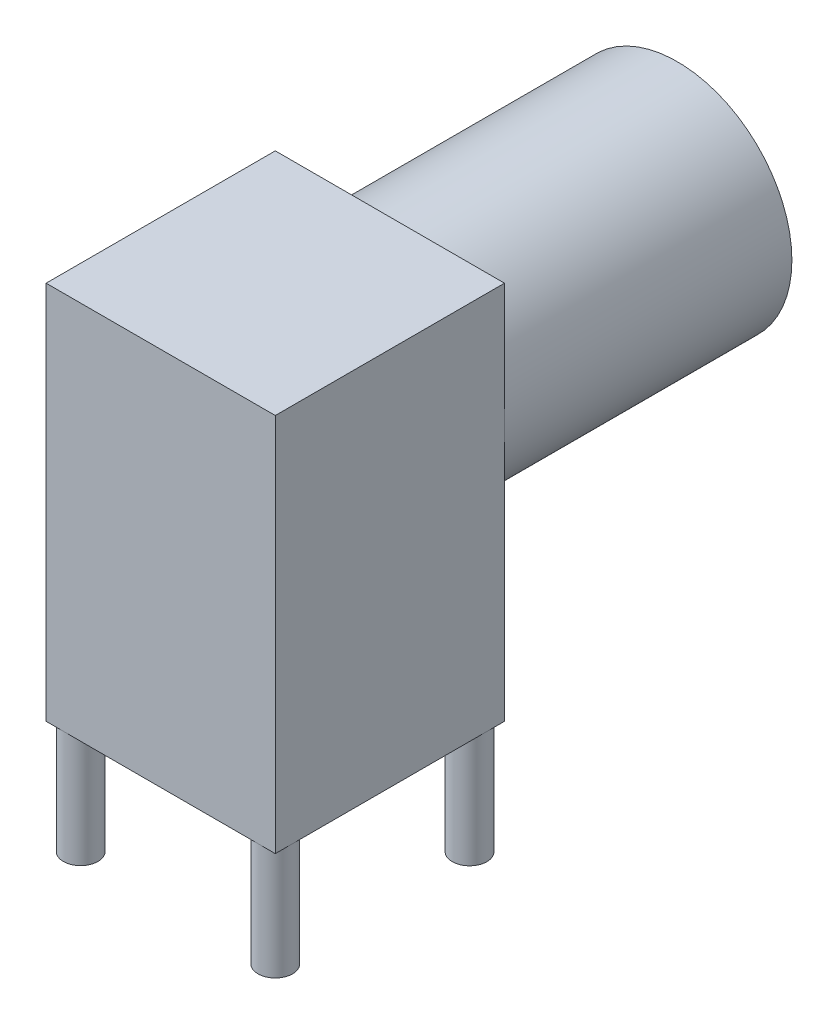
ISO-10303-21;
HEADER;
FILE_DESCRIPTION(('STEP AP214'),'2;1');
FILE_NAME('part.step','',(''),(''),'','','');
FILE_SCHEMA(('AUTOMOTIVE_DESIGN { 1 0 10303 214 1 1 1 1 }'));
ENDSEC;
DATA;
#1=APPLICATION_CONTEXT('core data for automotive mechanical design processes');
#2=APPLICATION_PROTOCOL_DEFINITION('international standard','automotive_design',2000,#1);
#3=PRODUCT_CONTEXT('',#1,'mechanical');
#4=PRODUCT('Part','Part','',(#3));
#5=PRODUCT_RELATED_PRODUCT_CATEGORY('part','',(#4));
#6=PRODUCT_DEFINITION_FORMATION('','',#4);
#7=PRODUCT_DEFINITION_CONTEXT('part definition',#1,'design');
#8=PRODUCT_DEFINITION('design','',#6,#7);
#9=PRODUCT_DEFINITION_SHAPE('','',#8);
#10=(LENGTH_UNIT() NAMED_UNIT(*) SI_UNIT(.MILLI.,.METRE.));
#11=(NAMED_UNIT(*) PLANE_ANGLE_UNIT() SI_UNIT($,.RADIAN.));
#12=(NAMED_UNIT(*) SI_UNIT($,.STERADIAN.) SOLID_ANGLE_UNIT());
#13=UNCERTAINTY_MEASURE_WITH_UNIT(LENGTH_MEASURE(1.E-05),#10,'distance_accuracy_value','');
#14=(GEOMETRIC_REPRESENTATION_CONTEXT(3) GLOBAL_UNCERTAINTY_ASSIGNED_CONTEXT((#13)) GLOBAL_UNIT_ASSIGNED_CONTEXT((#10,
#11,#12)) REPRESENTATION_CONTEXT('',''));
#15=CARTESIAN_POINT('',(0.,0.,0.));
#16=DIRECTION('',(0.,0.,1.));
#17=DIRECTION('',(1.,0.,0.));
#18=AXIS2_PLACEMENT_3D('',#15,#16,#17);
#19=CARTESIAN_POINT('',(0.,0.,0.));
#20=DIRECTION('',(0.,1.,0.));
#21=DIRECTION('',(0.,0.,1.));
#22=AXIS2_PLACEMENT_3D('',#19,#20,#21);
#23=PLANE('',#22);
#24=CARTESIAN_POINT('',(0.,0.,0.));
#25=DIRECTION('',(0.,1.,0.));
#26=DIRECTION('',(0.,0.,1.));
#27=AXIS2_PLACEMENT_3D('',#24,#25,#26);
#28=CIRCLE('',#27,0.475);
#29=CARTESIAN_POINT('',(0.,0.,0.475));
#30=VERTEX_POINT('',#29);
#31=EDGE_CURVE('E11',#30,#30,#28,.F.);
#32=ORIENTED_EDGE('',*,*,#31,.F.);
#33=EDGE_LOOP('',(#32));
#34=FACE_BOUND('',#33,.T.);
#35=DIRECTION('',(0.,0.,-1.));
#36=VECTOR('',#35,1.);
#37=CARTESIAN_POINT('',(3.15,0.,3.15));
#38=LINE('',#37,#36);
#39=CARTESIAN_POINT('',(3.15,0.,-2.66524354008799));
#40=VERTEX_POINT('',#39);
#41=CARTESIAN_POINT('',(3.15,0.,-3.15));
#42=VERTEX_POINT('',#41);
#43=EDGE_CURVE('E103',#40,#42,#38,.T.);
#44=ORIENTED_EDGE('',*,*,#43,.F.);
#45=CARTESIAN_POINT('',(2.675,0.,-2.66524354008799));
#46=DIRECTION('',(0.,-1.,0.));
#47=DIRECTION('',(0.,0.,-1.));
#48=AXIS2_PLACEMENT_3D('',#45,#46,#47);
#49=CIRCLE('',#48,0.475);
#50=EDGE_CURVE('E114',#40,#40,#49,.T.);
#51=ORIENTED_EDGE('',*,*,#50,.F.);
#52=CARTESIAN_POINT('',(3.15,0.,2.675));
#53=VERTEX_POINT('',#52);
#54=EDGE_CURVE('E99',#53,#40,#38,.T.);
#55=ORIENTED_EDGE('',*,*,#54,.F.);
#56=CARTESIAN_POINT('',(2.675,0.,2.675));
#57=DIRECTION('',(0.,-1.,0.));
#58=DIRECTION('',(0.,0.,-1.));
#59=AXIS2_PLACEMENT_3D('',#56,#57,#58);
#60=CIRCLE('',#59,0.475);
#61=CARTESIAN_POINT('',(2.675,0.,3.15));
#62=VERTEX_POINT('',#61);
#63=EDGE_CURVE('E167',#62,#53,#60,.T.);
#64=ORIENTED_EDGE('',*,*,#63,.F.);
#65=DIRECTION('',(1.,0.,0.));
#66=VECTOR('',#65,1.);
#67=CARTESIAN_POINT('',(3.15,0.,3.15));
#68=LINE('',#67,#66);
#69=CARTESIAN_POINT('',(-2.675,0.,3.15));
#70=VERTEX_POINT('',#69);
#71=EDGE_CURVE('E119',#70,#62,#68,.T.);
#72=ORIENTED_EDGE('',*,*,#71,.F.);
#73=CARTESIAN_POINT('',(-2.675,0.,2.675));
#74=DIRECTION('',(0.,-1.,0.));
#75=DIRECTION('',(0.,0.,-1.));
#76=AXIS2_PLACEMENT_3D('',#73,#74,#75);
#77=CIRCLE('',#76,0.475);
#78=CARTESIAN_POINT('',(-3.15,0.,2.675));
#79=VERTEX_POINT('',#78);
#80=EDGE_CURVE('E163',#79,#70,#77,.T.);
#81=ORIENTED_EDGE('',*,*,#80,.F.);
#82=DIRECTION('',(0.,0.,1.));
#83=VECTOR('',#82,1.);
#84=CARTESIAN_POINT('',(-3.15,0.,3.15));
#85=LINE('',#84,#83);
#86=CARTESIAN_POINT('',(-3.15,0.,-2.66524354008799));
#87=VERTEX_POINT('',#86);
#88=EDGE_CURVE('E56',#87,#79,#85,.T.);
#89=ORIENTED_EDGE('',*,*,#88,.F.);
#90=CARTESIAN_POINT('',(-2.675,0.,-2.66524354008799));
#91=DIRECTION('',(0.,-1.,0.));
#92=DIRECTION('',(0.,0.,-1.));
#93=AXIS2_PLACEMENT_3D('',#90,#91,#92);
#94=CIRCLE('',#93,0.475);
#95=EDGE_CURVE('E170',#87,#87,#94,.T.);
#96=ORIENTED_EDGE('',*,*,#95,.F.);
#97=CARTESIAN_POINT('',(-3.15,0.,-3.15));
#98=VERTEX_POINT('',#97);
#99=EDGE_CURVE('E223',#98,#87,#85,.T.);
#100=ORIENTED_EDGE('',*,*,#99,.F.);
#101=DIRECTION('',(-1.,0.,0.));
#102=VECTOR('',#101,1.);
#103=CARTESIAN_POINT('',(3.15,0.,-3.15));
#104=LINE('',#103,#102);
#105=EDGE_CURVE('E117',#42,#98,#104,.T.);
#106=ORIENTED_EDGE('',*,*,#105,.F.);
#107=EDGE_LOOP('',(#44,#51,#55,#64,#72,#81,#89,#96,#100,#106));
#108=FACE_BOUND('',#107,.T.);
#109=ADVANCED_FACE('F33',(#34,#108),#23,.F.);
#110=EDGE_CURVE('E48',#53,#62,#60,.T.);
#111=ORIENTED_EDGE('',*,*,#110,.F.);
#112=CARTESIAN_POINT('',(3.15,0.,3.15));
#113=VERTEX_POINT('',#112);
#114=EDGE_CURVE('E106',#113,#53,#38,.T.);
#115=ORIENTED_EDGE('',*,*,#114,.F.);
#116=EDGE_CURVE('E121',#62,#113,#68,.T.);
#117=ORIENTED_EDGE('',*,*,#116,.F.);
#118=EDGE_LOOP('',(#111,#115,#117));
#119=FACE_BOUND('',#118,.T.);
#120=ADVANCED_FACE('F197',(#119),#23,.F.);
#121=EDGE_CURVE('E159',#70,#79,#77,.T.);
#122=ORIENTED_EDGE('',*,*,#121,.F.);
#123=CARTESIAN_POINT('',(-3.15,0.,3.15));
#124=VERTEX_POINT('',#123);
#125=EDGE_CURVE('E118',#124,#70,#68,.T.);
#126=ORIENTED_EDGE('',*,*,#125,.F.);
#127=EDGE_CURVE('E152',#79,#124,#85,.T.);
#128=ORIENTED_EDGE('',*,*,#127,.F.);
#129=EDGE_LOOP('',(#122,#126,#128));
#130=FACE_BOUND('',#129,.T.);
#131=ADVANCED_FACE('F200',(#130),#23,.F.);
#132=CARTESIAN_POINT('',(3.15,10.43,-3.15));
#133=DIRECTION('',(0.,0.,1.));
#134=DIRECTION('',(1.,0.,0.));
#135=AXIS2_PLACEMENT_3D('',#132,#133,#134);
#136=PLANE('',#135);
#137=CARTESIAN_POINT('',(0.,7.02921902284004,-3.15));
#138=DIRECTION('',(0.,0.,-1.));
#139=DIRECTION('',(-1.,0.,0.));
#140=AXIS2_PLACEMENT_3D('',#137,#138,#139);
#141=CIRCLE('',#140,3.15);
#142=CARTESIAN_POINT('',(-3.15,7.02921902284004,-3.15));
#143=VERTEX_POINT('',#142);
#144=CARTESIAN_POINT('',(3.15,7.02921902284004,-3.15));
#145=VERTEX_POINT('',#144);
#146=EDGE_CURVE('E144',#143,#145,#141,.T.);
#147=ORIENTED_EDGE('',*,*,#146,.F.);
#148=DIRECTION('',(0.,-1.,0.));
#149=VECTOR('',#148,1.);
#150=CARTESIAN_POINT('',(-3.15,10.43,-3.15));
#151=LINE('',#150,#149);
#152=CARTESIAN_POINT('',(-3.15,10.43,-3.15));
#153=VERTEX_POINT('',#152);
#154=EDGE_CURVE('E130',#153,#143,#151,.T.);
#155=ORIENTED_EDGE('',*,*,#154,.F.);
#156=DIRECTION('',(-1.,0.,0.));
#157=VECTOR('',#156,1.);
#158=CARTESIAN_POINT('',(3.15,10.43,-3.15));
#159=LINE('',#158,#157);
#160=CARTESIAN_POINT('',(3.15,10.43,-3.15));
#161=VERTEX_POINT('',#160);
#162=EDGE_CURVE('E226',#161,#153,#159,.T.);
#163=ORIENTED_EDGE('',*,*,#162,.F.);
#164=DIRECTION('',(0.,-1.,0.));
#165=VECTOR('',#164,1.);
#166=CARTESIAN_POINT('',(3.15,10.43,-3.15));
#167=LINE('',#166,#165);
#168=EDGE_CURVE('E134',#161,#145,#167,.T.);
#169=ORIENTED_EDGE('',*,*,#168,.T.);
#170=EDGE_LOOP('',(#147,#155,#163,#169));
#171=FACE_BOUND('',#170,.T.);
#172=ADVANCED_FACE('F208',(#171),#136,.F.);
#173=EDGE_CURVE('E41',#145,#143,#141,.T.);
#174=ORIENTED_EDGE('',*,*,#173,.F.);
#175=EDGE_CURVE('E132',#145,#42,#167,.T.);
#176=ORIENTED_EDGE('',*,*,#175,.T.);
#177=ORIENTED_EDGE('',*,*,#105,.T.);
#178=EDGE_CURVE('E133',#143,#98,#151,.T.);
#179=ORIENTED_EDGE('',*,*,#178,.F.);
#180=EDGE_LOOP('',(#174,#176,#177,#179));
#181=FACE_BOUND('',#180,.T.);
#182=ADVANCED_FACE('F213',(#181),#136,.F.);
#183=CARTESIAN_POINT('',(-3.15,10.43,3.15));
#184=DIRECTION('',(1.,0.,0.));
#185=DIRECTION('',(0.,0.,-1.));
#186=AXIS2_PLACEMENT_3D('',#183,#184,#185);
#187=PLANE('',#186);
#188=ORIENTED_EDGE('',*,*,#99,.T.);
#189=ORIENTED_EDGE('',*,*,#88,.T.);
#190=ORIENTED_EDGE('',*,*,#127,.T.);
#191=DIRECTION('',(0.,-1.,0.));
#192=VECTOR('',#191,1.);
#193=CARTESIAN_POINT('',(-3.15,10.43,3.15));
#194=LINE('',#193,#192);
#195=CARTESIAN_POINT('',(-3.15,10.43,3.15));
#196=VERTEX_POINT('',#195);
#197=EDGE_CURVE('E138',#196,#124,#194,.T.);
#198=ORIENTED_EDGE('',*,*,#197,.F.);
#199=DIRECTION('',(0.,0.,1.));
#200=VECTOR('',#199,1.);
#201=CARTESIAN_POINT('',(-3.15,10.43,3.15));
#202=LINE('',#201,#200);
#203=EDGE_CURVE('E123',#153,#196,#202,.T.);
#204=ORIENTED_EDGE('',*,*,#203,.F.);
#205=ORIENTED_EDGE('',*,*,#154,.T.);
#206=ORIENTED_EDGE('',*,*,#178,.T.);
#207=EDGE_LOOP('',(#188,#189,#190,#198,#204,#205,#206));
#208=FACE_BOUND('',#207,.T.);
#209=ADVANCED_FACE('F35',(#208),#187,.F.);
#210=CARTESIAN_POINT('',(3.15,10.43,3.15));
#211=DIRECTION('',(0.,0.,-1.));
#212=DIRECTION('',(-1.,0.,0.));
#213=AXIS2_PLACEMENT_3D('',#210,#211,#212);
#214=PLANE('',#213);
#215=ORIENTED_EDGE('',*,*,#125,.T.);
#216=ORIENTED_EDGE('',*,*,#71,.T.);
#217=ORIENTED_EDGE('',*,*,#116,.T.);
#218=DIRECTION('',(0.,-1.,0.));
#219=VECTOR('',#218,1.);
#220=CARTESIAN_POINT('',(3.15,10.43,3.15));
#221=LINE('',#220,#219);
#222=CARTESIAN_POINT('',(3.15,10.43,3.15));
#223=VERTEX_POINT('',#222);
#224=EDGE_CURVE('E137',#223,#113,#221,.T.);
#225=ORIENTED_EDGE('',*,*,#224,.F.);
#226=DIRECTION('',(1.,0.,0.));
#227=VECTOR('',#226,1.);
#228=CARTESIAN_POINT('',(3.15,10.43,3.15));
#229=LINE('',#228,#227);
#230=EDGE_CURVE('E127',#196,#223,#229,.T.);
#231=ORIENTED_EDGE('',*,*,#230,.F.);
#232=ORIENTED_EDGE('',*,*,#197,.T.);
#233=EDGE_LOOP('',(#215,#216,#217,#225,#231,#232));
#234=FACE_BOUND('',#233,.T.);
#235=ADVANCED_FACE('F236',(#234),#214,.F.);
#236=CARTESIAN_POINT('',(3.15,10.43,3.15));
#237=DIRECTION('',(-1.,0.,0.));
#238=DIRECTION('',(0.,0.,1.));
#239=AXIS2_PLACEMENT_3D('',#236,#237,#238);
#240=PLANE('',#239);
#241=ORIENTED_EDGE('',*,*,#114,.T.);
#242=ORIENTED_EDGE('',*,*,#54,.T.);
#243=ORIENTED_EDGE('',*,*,#43,.T.);
#244=ORIENTED_EDGE('',*,*,#175,.F.);
#245=ORIENTED_EDGE('',*,*,#168,.F.);
#246=DIRECTION('',(0.,0.,-1.));
#247=VECTOR('',#246,1.);
#248=CARTESIAN_POINT('',(3.15,10.43,3.15));
#249=LINE('',#248,#247);
#250=EDGE_CURVE('E228',#223,#161,#249,.T.);
#251=ORIENTED_EDGE('',*,*,#250,.F.);
#252=ORIENTED_EDGE('',*,*,#224,.T.);
#253=EDGE_LOOP('',(#241,#242,#243,#244,#245,#251,#252));
#254=FACE_BOUND('',#253,.T.);
#255=ADVANCED_FACE('F101',(#254),#240,.F.);
#256=CARTESIAN_POINT('',(0.,10.43,0.));
#257=DIRECTION('',(0.,1.,0.));
#258=DIRECTION('',(0.,0.,1.));
#259=AXIS2_PLACEMENT_3D('',#256,#257,#258);
#260=PLANE('',#259);
#261=ORIENTED_EDGE('',*,*,#203,.T.);
#262=ORIENTED_EDGE('',*,*,#230,.T.);
#263=ORIENTED_EDGE('',*,*,#250,.T.);
#264=ORIENTED_EDGE('',*,*,#162,.T.);
#265=EDGE_LOOP('',(#261,#262,#263,#264));
#266=FACE_BOUND('',#265,.T.);
#267=ADVANCED_FACE('F232',(#266),#260,.T.);
#268=CARTESIAN_POINT('',(0.,7.02921902284004,-11.05));
#269=DIRECTION('',(0.,0.,1.));
#270=DIRECTION('',(1.,0.,0.));
#271=AXIS2_PLACEMENT_3D('',#268,#269,#270);
#272=CYLINDRICAL_SURFACE('',#271,3.15);
#273=CARTESIAN_POINT('',(0.,7.02921902284004,-11.05));
#274=DIRECTION('',(0.,0.,-1.));
#275=DIRECTION('',(-1.,0.,0.));
#276=AXIS2_PLACEMENT_3D('',#273,#274,#275);
#277=CIRCLE('',#276,3.15);
#278=CARTESIAN_POINT('',(-3.15,7.02921902284004,-11.05));
#279=VERTEX_POINT('',#278);
#280=EDGE_CURVE('E148',#279,#279,#277,.T.);
#281=ORIENTED_EDGE('',*,*,#280,.F.);
#282=EDGE_LOOP('',(#281));
#283=FACE_BOUND('',#282,.T.);
#284=ORIENTED_EDGE('',*,*,#146,.T.);
#285=ORIENTED_EDGE('',*,*,#173,.T.);
#286=EDGE_LOOP('',(#284,#285));
#287=FACE_BOUND('',#286,.T.);
#288=ADVANCED_FACE('F251',(#283,#287),#272,.T.);
#289=CARTESIAN_POINT('',(0.,7.02921902284004,-11.05));
#290=DIRECTION('',(0.,0.,-1.));
#291=DIRECTION('',(-1.,0.,0.));
#292=AXIS2_PLACEMENT_3D('',#289,#290,#291);
#293=PLANE('',#292);
#294=ORIENTED_EDGE('',*,*,#280,.T.);
#295=EDGE_LOOP('',(#294));
#296=FACE_BOUND('',#295,.T.);
#297=ADVANCED_FACE('F255',(#296),#293,.T.);
#298=CARTESIAN_POINT('',(0.,-3.1,0.));
#299=DIRECTION('',(0.,1.,0.));
#300=DIRECTION('',(0.,0.,1.));
#301=AXIS2_PLACEMENT_3D('',#298,#299,#300);
#302=CYLINDRICAL_SURFACE('',#301,0.475);
#303=CARTESIAN_POINT('',(0.,-3.1,0.));
#304=DIRECTION('',(0.,-1.,0.));
#305=DIRECTION('',(0.,0.,-1.));
#306=AXIS2_PLACEMENT_3D('',#303,#304,#305);
#307=CIRCLE('',#306,0.475);
#308=CARTESIAN_POINT('',(0.,-3.1,-0.475));
#309=VERTEX_POINT('',#308);
#310=EDGE_CURVE('E149',#309,#309,#307,.T.);
#311=ORIENTED_EDGE('',*,*,#310,.F.);
#312=EDGE_LOOP('',(#311));
#313=FACE_BOUND('',#312,.T.);
#314=ORIENTED_EDGE('',*,*,#31,.T.);
#315=EDGE_LOOP('',(#314));
#316=FACE_BOUND('',#315,.T.);
#317=ADVANCED_FACE('F261',(#313,#316),#302,.T.);
#318=CARTESIAN_POINT('',(0.,-3.1,0.));
#319=DIRECTION('',(0.,-1.,0.));
#320=DIRECTION('',(0.,0.,-1.));
#321=AXIS2_PLACEMENT_3D('',#318,#319,#320);
#322=PLANE('',#321);
#323=ORIENTED_EDGE('',*,*,#310,.T.);
#324=EDGE_LOOP('',(#323));
#325=FACE_BOUND('',#324,.T.);
#326=ADVANCED_FACE('F265',(#325),#322,.T.);
#327=CARTESIAN_POINT('',(-2.675,-3.1,2.675));
#328=DIRECTION('',(0.,1.,0.));
#329=DIRECTION('',(0.,0.,1.));
#330=AXIS2_PLACEMENT_3D('',#327,#328,#329);
#331=CYLINDRICAL_SURFACE('',#330,0.475);
#332=CARTESIAN_POINT('',(-2.675,-3.1,2.675));
#333=DIRECTION('',(0.,-1.,0.));
#334=DIRECTION('',(0.,0.,-1.));
#335=AXIS2_PLACEMENT_3D('',#332,#333,#334);
#336=CIRCLE('',#335,0.475);
#337=CARTESIAN_POINT('',(-2.675,-3.1,2.2));
#338=VERTEX_POINT('',#337);
#339=EDGE_CURVE('E154',#338,#338,#336,.T.);
#340=ORIENTED_EDGE('',*,*,#339,.F.);
#341=EDGE_LOOP('',(#340));
#342=FACE_BOUND('',#341,.T.);
#343=ORIENTED_EDGE('',*,*,#121,.T.);
#344=ORIENTED_EDGE('',*,*,#80,.T.);
#345=EDGE_LOOP('',(#343,#344));
#346=FACE_BOUND('',#345,.T.);
#347=ADVANCED_FACE('F220',(#342,#346),#331,.T.);
#348=CARTESIAN_POINT('',(-2.675,-3.1,2.675));
#349=DIRECTION('',(0.,-1.,0.));
#350=DIRECTION('',(0.,0.,-1.));
#351=AXIS2_PLACEMENT_3D('',#348,#349,#350);
#352=PLANE('',#351);
#353=ORIENTED_EDGE('',*,*,#339,.T.);
#354=EDGE_LOOP('',(#353));
#355=FACE_BOUND('',#354,.T.);
#356=ADVANCED_FACE('F271',(#355),#352,.T.);
#357=CARTESIAN_POINT('',(2.675,-3.1,2.675));
#358=DIRECTION('',(0.,1.,0.));
#359=DIRECTION('',(0.,0.,1.));
#360=AXIS2_PLACEMENT_3D('',#357,#358,#359);
#361=CYLINDRICAL_SURFACE('',#360,0.475);
#362=CARTESIAN_POINT('',(2.675,-3.1,2.675));
#363=DIRECTION('',(0.,-1.,0.));
#364=DIRECTION('',(0.,0.,-1.));
#365=AXIS2_PLACEMENT_3D('',#362,#363,#364);
#366=CIRCLE('',#365,0.475);
#367=CARTESIAN_POINT('',(2.675,-3.1,2.2));
#368=VERTEX_POINT('',#367);
#369=EDGE_CURVE('E166',#368,#368,#366,.T.);
#370=ORIENTED_EDGE('',*,*,#369,.F.);
#371=EDGE_LOOP('',(#370));
#372=FACE_BOUND('',#371,.T.);
#373=ORIENTED_EDGE('',*,*,#110,.T.);
#374=ORIENTED_EDGE('',*,*,#63,.T.);
#375=EDGE_LOOP('',(#373,#374));
#376=FACE_BOUND('',#375,.T.);
#377=ADVANCED_FACE('F275',(#372,#376),#361,.T.);
#378=CARTESIAN_POINT('',(2.675,-3.1,2.675));
#379=DIRECTION('',(0.,-1.,0.));
#380=DIRECTION('',(0.,0.,-1.));
#381=AXIS2_PLACEMENT_3D('',#378,#379,#380);
#382=PLANE('',#381);
#383=ORIENTED_EDGE('',*,*,#369,.T.);
#384=EDGE_LOOP('',(#383));
#385=FACE_BOUND('',#384,.T.);
#386=ADVANCED_FACE('F279',(#385),#382,.T.);
#387=CARTESIAN_POINT('',(-2.675,-3.1,-2.66524354008799));
#388=DIRECTION('',(0.,1.,0.));
#389=DIRECTION('',(0.,0.,1.));
#390=AXIS2_PLACEMENT_3D('',#387,#388,#389);
#391=CYLINDRICAL_SURFACE('',#390,0.475);
#392=CARTESIAN_POINT('',(-2.675,-3.1,-2.66524354008799));
#393=DIRECTION('',(0.,-1.,0.));
#394=DIRECTION('',(0.,0.,-1.));
#395=AXIS2_PLACEMENT_3D('',#392,#393,#394);
#396=CIRCLE('',#395,0.475);
#397=CARTESIAN_POINT('',(-2.675,-3.1,-3.14024354008799));
#398=VERTEX_POINT('',#397);
#399=EDGE_CURVE('E173',#398,#398,#396,.T.);
#400=ORIENTED_EDGE('',*,*,#399,.F.);
#401=EDGE_LOOP('',(#400));
#402=FACE_BOUND('',#401,.T.);
#403=ORIENTED_EDGE('',*,*,#95,.T.);
#404=EDGE_LOOP('',(#403));
#405=FACE_BOUND('',#404,.T.);
#406=ADVANCED_FACE('F193',(#402,#405),#391,.T.);
#407=CARTESIAN_POINT('',(-2.675,-3.1,-2.66524354008799));
#408=DIRECTION('',(0.,-1.,0.));
#409=DIRECTION('',(0.,0.,-1.));
#410=AXIS2_PLACEMENT_3D('',#407,#408,#409);
#411=PLANE('',#410);
#412=ORIENTED_EDGE('',*,*,#399,.T.);
#413=EDGE_LOOP('',(#412));
#414=FACE_BOUND('',#413,.T.);
#415=ADVANCED_FACE('F186',(#414),#411,.T.);
#416=CARTESIAN_POINT('',(2.675,-3.1,-2.66524354008799));
#417=DIRECTION('',(0.,1.,0.));
#418=DIRECTION('',(0.,0.,1.));
#419=AXIS2_PLACEMENT_3D('',#416,#417,#418);
#420=CYLINDRICAL_SURFACE('',#419,0.475);
#421=CARTESIAN_POINT('',(2.675,-3.1,-2.66524354008799));
#422=DIRECTION('',(0.,-1.,0.));
#423=DIRECTION('',(0.,0.,-1.));
#424=AXIS2_PLACEMENT_3D('',#421,#422,#423);
#425=CIRCLE('',#424,0.475);
#426=CARTESIAN_POINT('',(2.675,-3.1,-3.14024354008799));
#427=VERTEX_POINT('',#426);
#428=EDGE_CURVE('E174',#427,#427,#425,.T.);
#429=ORIENTED_EDGE('',*,*,#428,.F.);
#430=EDGE_LOOP('',(#429));
#431=FACE_BOUND('',#430,.T.);
#432=ORIENTED_EDGE('',*,*,#50,.T.);
#433=EDGE_LOOP('',(#432));
#434=FACE_BOUND('',#433,.T.);
#435=ADVANCED_FACE('F183',(#431,#434),#420,.T.);
#436=CARTESIAN_POINT('',(2.675,-3.1,-2.66524354008799));
#437=DIRECTION('',(0.,-1.,0.));
#438=DIRECTION('',(0.,0.,-1.));
#439=AXIS2_PLACEMENT_3D('',#436,#437,#438);
#440=PLANE('',#439);
#441=ORIENTED_EDGE('',*,*,#428,.T.);
#442=EDGE_LOOP('',(#441));
#443=FACE_BOUND('',#442,.T.);
#444=ADVANCED_FACE('F181',(#443),#440,.T.);
#445=CLOSED_SHELL('',(#109,#120,#131,#172,#182,#209,#235,#255,#267,#288,#297,#317,#326,#347,
#356,#377,#386,#406,#415,#435,#444));
#446=MANIFOLD_SOLID_BREP('B2',#445);
#447=ADVANCED_BREP_SHAPE_REPRESENTATION('',(#18,#446),#14);
#448=SHAPE_DEFINITION_REPRESENTATION(#9,#447);
ENDSEC;
END-ISO-10303-21;
